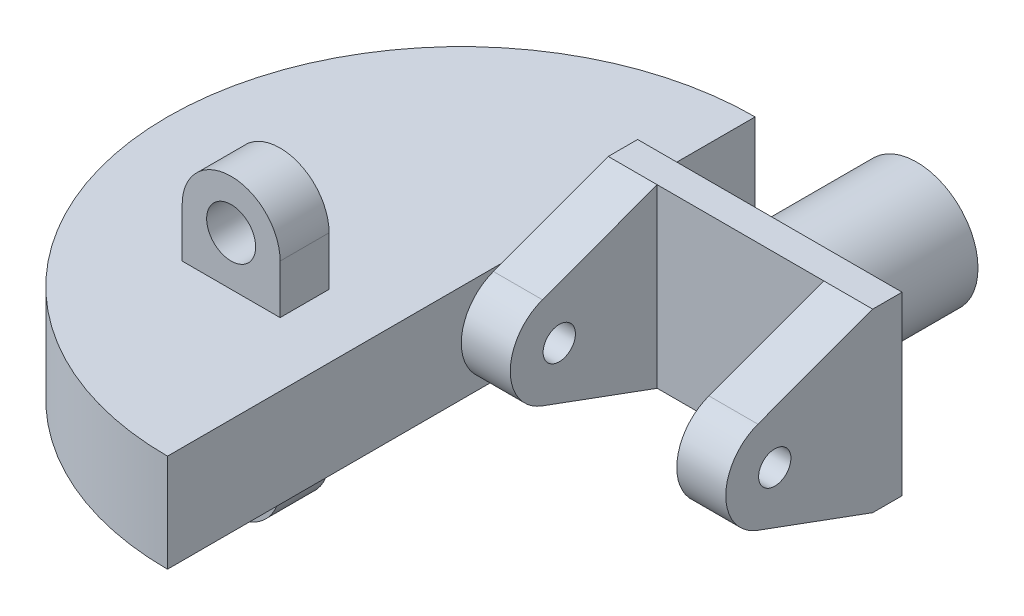
ISO-10303-21;
HEADER;
FILE_DESCRIPTION(('STEP AP214'),'2;1');
FILE_NAME('part.step','',(''),(''),'','','');
FILE_SCHEMA(('AUTOMOTIVE_DESIGN { 1 0 10303 214 1 1 1 1 }'));
ENDSEC;
DATA;
#1=APPLICATION_CONTEXT('core data for automotive mechanical design processes');
#2=APPLICATION_PROTOCOL_DEFINITION('international standard','automotive_design',2000,#1);
#3=PRODUCT_CONTEXT('',#1,'mechanical');
#4=PRODUCT('Part','Part','',(#3));
#5=PRODUCT_RELATED_PRODUCT_CATEGORY('part','',(#4));
#6=PRODUCT_DEFINITION_FORMATION('','',#4);
#7=PRODUCT_DEFINITION_CONTEXT('part definition',#1,'design');
#8=PRODUCT_DEFINITION('design','',#6,#7);
#9=PRODUCT_DEFINITION_SHAPE('','',#8);
#10=(LENGTH_UNIT() NAMED_UNIT(*) SI_UNIT(.MILLI.,.METRE.));
#11=(NAMED_UNIT(*) PLANE_ANGLE_UNIT() SI_UNIT($,.RADIAN.));
#12=(NAMED_UNIT(*) SI_UNIT($,.STERADIAN.) SOLID_ANGLE_UNIT());
#13=UNCERTAINTY_MEASURE_WITH_UNIT(LENGTH_MEASURE(1.E-05),#10,'distance_accuracy_value','');
#14=(GEOMETRIC_REPRESENTATION_CONTEXT(3) GLOBAL_UNCERTAINTY_ASSIGNED_CONTEXT((#13)) GLOBAL_UNIT_ASSIGNED_CONTEXT((#10,
#11,#12)) REPRESENTATION_CONTEXT('',''));
#15=CARTESIAN_POINT('',(0.,0.,0.));
#16=DIRECTION('',(0.,0.,1.));
#17=DIRECTION('',(1.,0.,0.));
#18=AXIS2_PLACEMENT_3D('',#15,#16,#17);
#19=CARTESIAN_POINT('',(-13.5,-5.,33.));
#20=DIRECTION('',(0.,1.,0.));
#21=DIRECTION('',(0.,0.,1.));
#22=AXIS2_PLACEMENT_3D('',#19,#20,#21);
#23=PLANE('',#22);
#24=CARTESIAN_POINT('',(-13.5,-5.,33.));
#25=DIRECTION('',(0.,1.,0.));
#26=DIRECTION('',(0.,0.,1.));
#27=AXIS2_PLACEMENT_3D('',#24,#25,#26);
#28=CIRCLE('',#27,30.);
#29=CARTESIAN_POINT('',(-13.5,-5.,3.));
#30=VERTEX_POINT('',#29);
#31=CARTESIAN_POINT('',(-13.5,-5.,63.));
#32=VERTEX_POINT('',#31);
#33=EDGE_CURVE('E245',#30,#32,#28,.T.);
#34=ORIENTED_EDGE('',*,*,#33,.F.);
#35=DIRECTION('',(0.,0.,-1.));
#36=VECTOR('',#35,1.);
#37=CARTESIAN_POINT('',(-13.5,-5.,63.));
#38=LINE('',#37,#36);
#39=CARTESIAN_POINT('',(-13.5,-5.,15.));
#40=VERTEX_POINT('',#39);
#41=EDGE_CURVE('E258',#40,#30,#38,.T.);
#42=ORIENTED_EDGE('',*,*,#41,.F.);
#43=CARTESIAN_POINT('',(-13.5,-5.,28.8892842845703));
#44=VERTEX_POINT('',#43);
#45=EDGE_CURVE('E261',#44,#40,#38,.T.);
#46=ORIENTED_EDGE('',*,*,#45,.F.);
#47=EDGE_CURVE('E250',#32,#44,#38,.T.);
#48=ORIENTED_EDGE('',*,*,#47,.F.);
#49=EDGE_LOOP('',(#34,#42,#46,#48));
#50=FACE_BOUND('',#49,.T.);
#51=DIRECTION('',(1.,0.,0.));
#52=VECTOR('',#51,1.);
#53=CARTESIAN_POINT('',(-30.,-5.,45.));
#54=LINE('',#53,#52);
#55=CARTESIAN_POINT('',(-30.,-5.,45.));
#56=VERTEX_POINT('',#55);
#57=CARTESIAN_POINT('',(-20.,-5.,45.));
#58=VERTEX_POINT('',#57);
#59=EDGE_CURVE('E185',#56,#58,#54,.T.);
#60=ORIENTED_EDGE('',*,*,#59,.T.);
#61=DIRECTION('',(0.,0.,-1.));
#62=VECTOR('',#61,1.);
#63=CARTESIAN_POINT('',(-20.,-5.,45.));
#64=LINE('',#63,#62);
#65=CARTESIAN_POINT('',(-20.,-5.,40.));
#66=VERTEX_POINT('',#65);
#67=EDGE_CURVE('E793',#58,#66,#64,.T.);
#68=ORIENTED_EDGE('',*,*,#67,.T.);
#69=DIRECTION('',(1.,0.,0.));
#70=VECTOR('',#69,1.);
#71=CARTESIAN_POINT('',(-30.,-5.,40.));
#72=LINE('',#71,#70);
#73=CARTESIAN_POINT('',(-30.,-5.,40.));
#74=VERTEX_POINT('',#73);
#75=EDGE_CURVE('E205',#74,#66,#72,.T.);
#76=ORIENTED_EDGE('',*,*,#75,.F.);
#77=DIRECTION('',(0.,0.,-1.));
#78=VECTOR('',#77,1.);
#79=CARTESIAN_POINT('',(-30.,-5.,45.));
#80=LINE('',#79,#78);
#81=EDGE_CURVE('E200',#56,#74,#80,.T.);
#82=ORIENTED_EDGE('',*,*,#81,.F.);
#83=EDGE_LOOP('',(#60,#68,#76,#82));
#84=FACE_BOUND('',#83,.T.);
#85=ADVANCED_FACE('F33',(#50,#84),#23,.F.);
#86=CARTESIAN_POINT('',(-13.5,5.,33.));
#87=DIRECTION('',(0.,1.,0.));
#88=DIRECTION('',(0.,0.,1.));
#89=AXIS2_PLACEMENT_3D('',#86,#87,#88);
#90=PLANE('',#89);
#91=CARTESIAN_POINT('',(-13.5,5.,33.));
#92=DIRECTION('',(0.,1.,0.));
#93=DIRECTION('',(0.,0.,1.));
#94=AXIS2_PLACEMENT_3D('',#91,#92,#93);
#95=CIRCLE('',#94,30.);
#96=CARTESIAN_POINT('',(-13.5,5.,3.));
#97=VERTEX_POINT('',#96);
#98=CARTESIAN_POINT('',(-13.5,5.,63.));
#99=VERTEX_POINT('',#98);
#100=EDGE_CURVE('E246',#97,#99,#95,.T.);
#101=ORIENTED_EDGE('',*,*,#100,.T.);
#102=DIRECTION('',(0.,0.,-1.));
#103=VECTOR('',#102,1.);
#104=CARTESIAN_POINT('',(-13.5,5.,63.));
#105=LINE('',#104,#103);
#106=CARTESIAN_POINT('',(-13.5,4.99999999999998,28.8892842845704));
#107=VERTEX_POINT('',#106);
#108=EDGE_CURVE('E251',#99,#107,#105,.T.);
#109=ORIENTED_EDGE('',*,*,#108,.T.);
#110=CARTESIAN_POINT('',(-13.5,5.,15.));
#111=VERTEX_POINT('',#110);
#112=EDGE_CURVE('E255',#107,#111,#105,.T.);
#113=ORIENTED_EDGE('',*,*,#112,.T.);
#114=EDGE_CURVE('E249',#111,#97,#105,.T.);
#115=ORIENTED_EDGE('',*,*,#114,.T.);
#116=EDGE_LOOP('',(#101,#109,#113,#115));
#117=FACE_BOUND('',#116,.T.);
#118=DIRECTION('',(1.,0.,0.));
#119=VECTOR('',#118,1.);
#120=CARTESIAN_POINT('',(-30.,5.,40.));
#121=LINE('',#120,#119);
#122=CARTESIAN_POINT('',(-30.,5.,40.));
#123=VERTEX_POINT('',#122);
#124=CARTESIAN_POINT('',(-20.,5.,40.));
#125=VERTEX_POINT('',#124);
#126=EDGE_CURVE('E56',#123,#125,#121,.T.);
#127=ORIENTED_EDGE('',*,*,#126,.T.);
#128=DIRECTION('',(0.,0.,-1.));
#129=VECTOR('',#128,1.);
#130=CARTESIAN_POINT('',(-20.,5.,45.));
#131=LINE('',#130,#129);
#132=CARTESIAN_POINT('',(-20.,5.,45.));
#133=VERTEX_POINT('',#132);
#134=EDGE_CURVE('E242',#133,#125,#131,.T.);
#135=ORIENTED_EDGE('',*,*,#134,.F.);
#136=DIRECTION('',(1.,0.,0.));
#137=VECTOR('',#136,1.);
#138=CARTESIAN_POINT('',(-30.,5.,45.));
#139=LINE('',#138,#137);
#140=CARTESIAN_POINT('',(-30.,5.,45.));
#141=VERTEX_POINT('',#140);
#142=EDGE_CURVE('E217',#141,#133,#139,.T.);
#143=ORIENTED_EDGE('',*,*,#142,.F.);
#144=DIRECTION('',(0.,0.,-1.));
#145=VECTOR('',#144,1.);
#146=CARTESIAN_POINT('',(-30.,5.,45.));
#147=LINE('',#146,#145);
#148=EDGE_CURVE('E227',#141,#123,#147,.T.);
#149=ORIENTED_EDGE('',*,*,#148,.T.);
#150=EDGE_LOOP('',(#127,#135,#143,#149));
#151=FACE_BOUND('',#150,.T.);
#152=ADVANCED_FACE('F388',(#117,#151),#90,.T.);
#153=CARTESIAN_POINT('',(-13.5,9.,18.));
#154=DIRECTION('',(1.,0.,0.));
#155=DIRECTION('',(0.,1.,0.));
#156=AXIS2_PLACEMENT_3D('',#153,#154,#155);
#157=PLANE('',#156);
#158=ORIENTED_EDGE('',*,*,#45,.T.);
#159=DIRECTION('',(0.,-1.,0.));
#160=VECTOR('',#159,1.);
#161=CARTESIAN_POINT('',(-13.5,9.,15.));
#162=LINE('',#161,#160);
#163=CARTESIAN_POINT('',(-13.5,-9.,15.));
#164=VERTEX_POINT('',#163);
#165=EDGE_CURVE('E352',#40,#164,#162,.T.);
#166=ORIENTED_EDGE('',*,*,#165,.T.);
#167=DIRECTION('',(0.,0.,-1.));
#168=VECTOR('',#167,1.);
#169=CARTESIAN_POINT('',(-13.5,-9.,18.));
#170=LINE('',#169,#168);
#171=CARTESIAN_POINT('',(-13.5,-9.,18.));
#172=VERTEX_POINT('',#171);
#173=EDGE_CURVE('E360',#172,#164,#170,.T.);
#174=ORIENTED_EDGE('',*,*,#173,.F.);
#175=DIRECTION('',(0.,-0.344806430779951,-0.938673811977724));
#176=VECTOR('',#175,1.);
#177=CARTESIAN_POINT('',(-13.5,-6.85995345527024,23.8258938019437));
#178=LINE('',#177,#176);
#179=EDGE_CURVE('E275',#44,#172,#178,.T.);
#180=ORIENTED_EDGE('',*,*,#179,.F.);
#181=EDGE_LOOP('',(#158,#166,#174,#180));
#182=FACE_BOUND('',#181,.T.);
#183=ADVANCED_FACE('F395',(#182),#157,.F.);
#184=CARTESIAN_POINT('',(0.,0.,18.));
#185=DIRECTION('',(0.,0.,1.));
#186=DIRECTION('',(1.,0.,0.));
#187=AXIS2_PLACEMENT_3D('',#184,#185,#186);
#188=PLANE('',#187);
#189=DIRECTION('',(0.,1.,0.));
#190=VECTOR('',#189,1.);
#191=CARTESIAN_POINT('',(-8.5,9.,18.));
#192=LINE('',#191,#190);
#193=CARTESIAN_POINT('',(-8.5,-9.,18.));
#194=VERTEX_POINT('',#193);
#195=CARTESIAN_POINT('',(-8.5,9.,18.));
#196=VERTEX_POINT('',#195);
#197=EDGE_CURVE('E281',#194,#196,#192,.T.);
#198=ORIENTED_EDGE('',*,*,#197,.F.);
#199=DIRECTION('',(1.,0.,0.));
#200=VECTOR('',#199,1.);
#201=CARTESIAN_POINT('',(-13.5,-9.,18.));
#202=LINE('',#201,#200);
#203=CARTESIAN_POINT('',(8.5,-9.,18.));
#204=VERTEX_POINT('',#203);
#205=EDGE_CURVE('E342',#194,#204,#202,.T.);
#206=ORIENTED_EDGE('',*,*,#205,.T.);
#207=DIRECTION('',(0.,1.,0.));
#208=VECTOR('',#207,1.);
#209=CARTESIAN_POINT('',(8.5,9.,18.));
#210=LINE('',#209,#208);
#211=CARTESIAN_POINT('',(8.5,9.,18.));
#212=VERTEX_POINT('',#211);
#213=EDGE_CURVE('E319',#204,#212,#210,.T.);
#214=ORIENTED_EDGE('',*,*,#213,.T.);
#215=DIRECTION('',(-1.,0.,0.));
#216=VECTOR('',#215,1.);
#217=CARTESIAN_POINT('',(-13.5,9.,18.));
#218=LINE('',#217,#216);
#219=EDGE_CURVE('E343',#212,#196,#218,.T.);
#220=ORIENTED_EDGE('',*,*,#219,.T.);
#221=EDGE_LOOP('',(#198,#206,#214,#220));
#222=FACE_BOUND('',#221,.T.);
#223=ADVANCED_FACE('F385',(#222),#188,.T.);
#224=CARTESIAN_POINT('',(0.,0.,15.));
#225=DIRECTION('',(0.,0.,-1.));
#226=DIRECTION('',(-1.,0.,0.));
#227=AXIS2_PLACEMENT_3D('',#224,#225,#226);
#228=CYLINDRICAL_SURFACE('',#227,6.25);
#229=CARTESIAN_POINT('',(0.,0.,15.));
#230=DIRECTION('',(0.,0.,1.));
#231=DIRECTION('',(1.,0.,0.));
#232=AXIS2_PLACEMENT_3D('',#229,#230,#231);
#233=CIRCLE('',#232,6.25);
#234=CARTESIAN_POINT('',(6.25,0.,15.));
#235=VERTEX_POINT('',#234);
#236=EDGE_CURVE('E11',#235,#235,#233,.T.);
#237=ORIENTED_EDGE('',*,*,#236,.F.);
#238=EDGE_LOOP('',(#237));
#239=FACE_BOUND('',#238,.T.);
#240=CARTESIAN_POINT('',(0.,0.,0.));
#241=DIRECTION('',(0.,0.,1.));
#242=DIRECTION('',(1.,0.,0.));
#243=AXIS2_PLACEMENT_3D('',#240,#241,#242);
#244=CIRCLE('',#243,6.25);
#245=CARTESIAN_POINT('',(6.25,0.,0.));
#246=VERTEX_POINT('',#245);
#247=EDGE_CURVE('E37',#246,#246,#244,.T.);
#248=ORIENTED_EDGE('',*,*,#247,.T.);
#249=EDGE_LOOP('',(#248));
#250=FACE_BOUND('',#249,.T.);
#251=ADVANCED_FACE('F35',(#239,#250),#228,.T.);
#252=CARTESIAN_POINT('',(0.,0.,0.));
#253=DIRECTION('',(0.,0.,1.));
#254=DIRECTION('',(1.,0.,0.));
#255=AXIS2_PLACEMENT_3D('',#252,#253,#254);
#256=PLANE('',#255);
#257=ORIENTED_EDGE('',*,*,#247,.F.);
#258=EDGE_LOOP('',(#257));
#259=FACE_BOUND('',#258,.T.);
#260=ADVANCED_FACE('F375',(#259),#256,.F.);
#261=CARTESIAN_POINT('',(13.5,9.,18.));
#262=DIRECTION('',(-1.,0.,0.));
#263=DIRECTION('',(0.,-1.,0.));
#264=AXIS2_PLACEMENT_3D('',#261,#262,#263);
#265=PLANE('',#264);
#266=DIRECTION('',(0.,1.,0.));
#267=VECTOR('',#266,1.);
#268=CARTESIAN_POINT('',(13.5,9.,15.));
#269=LINE('',#268,#267);
#270=CARTESIAN_POINT('',(13.5,-9.,15.));
#271=VERTEX_POINT('',#270);
#272=CARTESIAN_POINT('',(13.5,9.,15.));
#273=VERTEX_POINT('',#272);
#274=EDGE_CURVE('E338',#271,#273,#269,.T.);
#275=ORIENTED_EDGE('',*,*,#274,.T.);
#276=DIRECTION('',(0.,0.,-1.));
#277=VECTOR('',#276,1.);
#278=CARTESIAN_POINT('',(13.5,9.,18.));
#279=LINE('',#278,#277);
#280=CARTESIAN_POINT('',(13.5,9.,18.));
#281=VERTEX_POINT('',#280);
#282=EDGE_CURVE('E366',#281,#273,#279,.T.);
#283=ORIENTED_EDGE('',*,*,#282,.F.);
#284=DIRECTION('',(0.,-0.344806430779952,0.938673811977723));
#285=VECTOR('',#284,1.);
#286=CARTESIAN_POINT('',(13.5,9.,18.));
#287=LINE('',#286,#285);
#288=CARTESIAN_POINT('',(13.5,4.69336905988861,29.7240321538998));
#289=VERTEX_POINT('',#288);
#290=EDGE_CURVE('E328',#281,#289,#287,.T.);
#291=ORIENTED_EDGE('',*,*,#290,.T.);
#292=CARTESIAN_POINT('',(13.5,0.,28.));
#293=DIRECTION('',(-1.,0.,0.));
#294=DIRECTION('',(0.,-1.,0.));
#295=AXIS2_PLACEMENT_3D('',#292,#293,#294);
#296=CIRCLE('',#295,5.);
#297=CARTESIAN_POINT('',(13.5,-4.69336905988862,29.7240321538998));
#298=VERTEX_POINT('',#297);
#299=EDGE_CURVE('E310',#298,#289,#296,.T.);
#300=ORIENTED_EDGE('',*,*,#299,.F.);
#301=DIRECTION('',(0.,-0.344806430779951,-0.938673811977724));
#302=VECTOR('',#301,1.);
#303=CARTESIAN_POINT('',(13.5,-6.85995345527023,23.8258938019437));
#304=LINE('',#303,#302);
#305=CARTESIAN_POINT('',(13.5,-9.,18.));
#306=VERTEX_POINT('',#305);
#307=EDGE_CURVE('E316',#298,#306,#304,.T.);
#308=ORIENTED_EDGE('',*,*,#307,.T.);
#309=DIRECTION('',(0.,0.,-1.));
#310=VECTOR('',#309,1.);
#311=CARTESIAN_POINT('',(13.5,-9.,18.));
#312=LINE('',#311,#310);
#313=EDGE_CURVE('E347',#306,#271,#312,.T.);
#314=ORIENTED_EDGE('',*,*,#313,.T.);
#315=EDGE_LOOP('',(#275,#283,#291,#300,#308,#314));
#316=FACE_BOUND('',#315,.T.);
#317=CARTESIAN_POINT('',(13.5,0.,28.));
#318=DIRECTION('',(-1.,0.,0.));
#319=DIRECTION('',(0.,-1.,0.));
#320=AXIS2_PLACEMENT_3D('',#317,#318,#319);
#321=CIRCLE('',#320,1.65);
#322=CARTESIAN_POINT('',(13.5,-1.65,28.));
#323=VERTEX_POINT('',#322);
#324=EDGE_CURVE('E306',#323,#323,#321,.T.);
#325=ORIENTED_EDGE('',*,*,#324,.T.);
#326=EDGE_LOOP('',(#325));
#327=FACE_BOUND('',#326,.T.);
#328=ADVANCED_FACE('F377',(#316,#327),#265,.F.);
#329=CARTESIAN_POINT('',(-13.5,9.,18.));
#330=DIRECTION('',(0.,-1.,0.));
#331=DIRECTION('',(0.,0.,-1.));
#332=AXIS2_PLACEMENT_3D('',#329,#330,#331);
#333=PLANE('',#332);
#334=DIRECTION('',(-1.,0.,0.));
#335=VECTOR('',#334,1.);
#336=CARTESIAN_POINT('',(-13.5,9.,15.));
#337=LINE('',#336,#335);
#338=CARTESIAN_POINT('',(-13.5,9.,15.));
#339=VERTEX_POINT('',#338);
#340=EDGE_CURVE('E350',#273,#339,#337,.T.);
#341=ORIENTED_EDGE('',*,*,#340,.T.);
#342=DIRECTION('',(0.,0.,-1.));
#343=VECTOR('',#342,1.);
#344=CARTESIAN_POINT('',(-13.5,9.,18.));
#345=LINE('',#344,#343);
#346=CARTESIAN_POINT('',(-13.5,9.,18.));
#347=VERTEX_POINT('',#346);
#348=EDGE_CURVE('E363',#347,#339,#345,.T.);
#349=ORIENTED_EDGE('',*,*,#348,.F.);
#350=DIRECTION('',(-1.,0.,0.));
#351=VECTOR('',#350,1.);
#352=CARTESIAN_POINT('',(-8.5,9.,18.));
#353=LINE('',#352,#351);
#354=EDGE_CURVE('E303',#196,#347,#353,.T.);
#355=ORIENTED_EDGE('',*,*,#354,.F.);
#356=ORIENTED_EDGE('',*,*,#219,.F.);
#357=EDGE_CURVE('E339',#281,#212,#218,.T.);
#358=ORIENTED_EDGE('',*,*,#357,.F.);
#359=ORIENTED_EDGE('',*,*,#282,.T.);
#360=EDGE_LOOP('',(#341,#349,#355,#356,#358,#359));
#361=FACE_BOUND('',#360,.T.);
#362=ADVANCED_FACE('F382',(#361),#333,.F.);
#363=EDGE_CURVE('E353',#339,#111,#162,.T.);
#364=ORIENTED_EDGE('',*,*,#363,.T.);
#365=ORIENTED_EDGE('',*,*,#112,.F.);
#366=DIRECTION('',(0.,-0.344806430779952,0.938673811977724));
#367=VECTOR('',#366,1.);
#368=CARTESIAN_POINT('',(-13.5,9.,18.));
#369=LINE('',#368,#367);
#370=EDGE_CURVE('E293',#347,#107,#369,.T.);
#371=ORIENTED_EDGE('',*,*,#370,.F.);
#372=ORIENTED_EDGE('',*,*,#348,.T.);
#373=EDGE_LOOP('',(#364,#365,#371,#372));
#374=FACE_BOUND('',#373,.T.);
#375=ADVANCED_FACE('F462',(#374),#157,.F.);
#376=CARTESIAN_POINT('',(-13.5,-9.,18.));
#377=DIRECTION('',(0.,1.,0.));
#378=DIRECTION('',(0.,0.,1.));
#379=AXIS2_PLACEMENT_3D('',#376,#377,#378);
#380=PLANE('',#379);
#381=DIRECTION('',(1.,0.,0.));
#382=VECTOR('',#381,1.);
#383=CARTESIAN_POINT('',(-13.5,-9.,15.));
#384=LINE('',#383,#382);
#385=EDGE_CURVE('E356',#164,#271,#384,.T.);
#386=ORIENTED_EDGE('',*,*,#385,.T.);
#387=ORIENTED_EDGE('',*,*,#313,.F.);
#388=DIRECTION('',(1.,0.,0.));
#389=VECTOR('',#388,1.);
#390=CARTESIAN_POINT('',(8.5,-9.,18.));
#391=LINE('',#390,#389);
#392=EDGE_CURVE('E334',#204,#306,#391,.T.);
#393=ORIENTED_EDGE('',*,*,#392,.F.);
#394=ORIENTED_EDGE('',*,*,#205,.F.);
#395=EDGE_CURVE('E344',#172,#194,#202,.T.);
#396=ORIENTED_EDGE('',*,*,#395,.F.);
#397=ORIENTED_EDGE('',*,*,#173,.T.);
#398=EDGE_LOOP('',(#386,#387,#393,#394,#396,#397));
#399=FACE_BOUND('',#398,.T.);
#400=ADVANCED_FACE('F458',(#399),#380,.F.);
#401=CARTESIAN_POINT('',(0.,0.,15.));
#402=DIRECTION('',(0.,0.,1.));
#403=DIRECTION('',(1.,0.,0.));
#404=AXIS2_PLACEMENT_3D('',#401,#402,#403);
#405=PLANE('',#404);
#406=ORIENTED_EDGE('',*,*,#236,.T.);
#407=EDGE_LOOP('',(#406));
#408=FACE_BOUND('',#407,.T.);
#409=ORIENTED_EDGE('',*,*,#274,.F.);
#410=ORIENTED_EDGE('',*,*,#385,.F.);
#411=ORIENTED_EDGE('',*,*,#165,.F.);
#412=DIRECTION('',(0.,-1.,0.));
#413=VECTOR('',#412,1.);
#414=CARTESIAN_POINT('',(-13.5,0.,15.));
#415=LINE('',#414,#413);
#416=EDGE_CURVE('E269',#111,#40,#415,.T.);
#417=ORIENTED_EDGE('',*,*,#416,.F.);
#418=ORIENTED_EDGE('',*,*,#363,.F.);
#419=ORIENTED_EDGE('',*,*,#340,.F.);
#420=EDGE_LOOP('',(#409,#410,#411,#417,#418,#419));
#421=FACE_BOUND('',#420,.T.);
#422=ADVANCED_FACE('F441',(#408,#421),#405,.F.);
#423=CARTESIAN_POINT('',(8.5,0.,28.));
#424=DIRECTION('',(-1.,0.,0.));
#425=DIRECTION('',(0.,-1.,0.));
#426=AXIS2_PLACEMENT_3D('',#423,#424,#425);
#427=PLANE('',#426);
#428=CARTESIAN_POINT('',(8.5,0.,28.));
#429=DIRECTION('',(-1.,0.,0.));
#430=DIRECTION('',(0.,-1.,0.));
#431=AXIS2_PLACEMENT_3D('',#428,#429,#430);
#432=CIRCLE('',#431,5.);
#433=CARTESIAN_POINT('',(8.5,-4.69336905988862,29.7240321538998));
#434=VERTEX_POINT('',#433);
#435=CARTESIAN_POINT('',(8.5,4.69336905988861,29.7240321538998));
#436=VERTEX_POINT('',#435);
#437=EDGE_CURVE('E313',#434,#436,#432,.T.);
#438=ORIENTED_EDGE('',*,*,#437,.T.);
#439=DIRECTION('',(0.,-0.344806430779952,0.938673811977723));
#440=VECTOR('',#439,1.);
#441=CARTESIAN_POINT('',(8.5,9.,18.));
#442=LINE('',#441,#440);
#443=EDGE_CURVE('E315',#212,#436,#442,.T.);
#444=ORIENTED_EDGE('',*,*,#443,.F.);
#445=ORIENTED_EDGE('',*,*,#213,.F.);
#446=DIRECTION('',(0.,-0.344806430779951,-0.938673811977724));
#447=VECTOR('',#446,1.);
#448=CARTESIAN_POINT('',(8.5,-6.85995345527023,23.8258938019437));
#449=LINE('',#448,#447);
#450=EDGE_CURVE('E322',#434,#204,#449,.T.);
#451=ORIENTED_EDGE('',*,*,#450,.F.);
#452=EDGE_LOOP('',(#438,#444,#445,#451));
#453=FACE_BOUND('',#452,.T.);
#454=CARTESIAN_POINT('',(8.5,0.,28.));
#455=DIRECTION('',(-1.,0.,0.));
#456=DIRECTION('',(0.,-1.,0.));
#457=AXIS2_PLACEMENT_3D('',#454,#455,#456);
#458=CIRCLE('',#457,1.65);
#459=CARTESIAN_POINT('',(8.5,-1.65,28.));
#460=VERTEX_POINT('',#459);
#461=EDGE_CURVE('E307',#460,#460,#458,.T.);
#462=ORIENTED_EDGE('',*,*,#461,.F.);
#463=EDGE_LOOP('',(#462));
#464=FACE_BOUND('',#463,.T.);
#465=ADVANCED_FACE('F437',(#453,#464),#427,.T.);
#466=CARTESIAN_POINT('',(8.5,0.,28.));
#467=DIRECTION('',(1.,0.,0.));
#468=DIRECTION('',(0.,0.,-1.));
#469=AXIS2_PLACEMENT_3D('',#466,#467,#468);
#470=CYLINDRICAL_SURFACE('',#469,5.);
#471=ORIENTED_EDGE('',*,*,#299,.T.);
#472=DIRECTION('',(1.,0.,0.));
#473=VECTOR('',#472,1.);
#474=CARTESIAN_POINT('',(8.5,4.69336905988861,29.7240321538998));
#475=LINE('',#474,#473);
#476=EDGE_CURVE('E336',#436,#289,#475,.T.);
#477=ORIENTED_EDGE('',*,*,#476,.F.);
#478=ORIENTED_EDGE('',*,*,#437,.F.);
#479=DIRECTION('',(1.,0.,0.));
#480=VECTOR('',#479,1.);
#481=CARTESIAN_POINT('',(8.5,-4.69336905988862,29.7240321538998));
#482=LINE('',#481,#480);
#483=EDGE_CURVE('E325',#434,#298,#482,.T.);
#484=ORIENTED_EDGE('',*,*,#483,.T.);
#485=EDGE_LOOP('',(#471,#477,#478,#484));
#486=FACE_BOUND('',#485,.T.);
#487=ADVANCED_FACE('F440',(#486),#470,.T.);
#488=CARTESIAN_POINT('',(8.5,9.,18.));
#489=DIRECTION('',(0.,0.938673811977723,0.344806430779952));
#490=DIRECTION('',(0.,-0.344806430779952,0.938673811977724));
#491=AXIS2_PLACEMENT_3D('',#488,#489,#490);
#492=PLANE('',#491);
#493=ORIENTED_EDGE('',*,*,#290,.F.);
#494=ORIENTED_EDGE('',*,*,#357,.T.);
#495=ORIENTED_EDGE('',*,*,#443,.T.);
#496=ORIENTED_EDGE('',*,*,#476,.T.);
#497=EDGE_LOOP('',(#493,#494,#495,#496));
#498=FACE_BOUND('',#497,.T.);
#499=ADVANCED_FACE('F445',(#498),#492,.T.);
#500=CARTESIAN_POINT('',(8.5,-6.85995345527023,23.8258938019437));
#501=DIRECTION('',(0.,-0.938673811977724,0.344806430779951));
#502=DIRECTION('',(0.,-0.344806430779951,-0.938673811977724));
#503=AXIS2_PLACEMENT_3D('',#500,#501,#502);
#504=PLANE('',#503);
#505=ORIENTED_EDGE('',*,*,#307,.F.);
#506=ORIENTED_EDGE('',*,*,#483,.F.);
#507=ORIENTED_EDGE('',*,*,#450,.T.);
#508=ORIENTED_EDGE('',*,*,#392,.T.);
#509=EDGE_LOOP('',(#505,#506,#507,#508));
#510=FACE_BOUND('',#509,.T.);
#511=ADVANCED_FACE('F435',(#510),#504,.T.);
#512=CARTESIAN_POINT('',(8.5,0.,28.));
#513=DIRECTION('',(1.,0.,0.));
#514=DIRECTION('',(0.,0.,-1.));
#515=AXIS2_PLACEMENT_3D('',#512,#513,#514);
#516=CYLINDRICAL_SURFACE('',#515,1.65);
#517=ORIENTED_EDGE('',*,*,#461,.T.);
#518=EDGE_LOOP('',(#517));
#519=FACE_BOUND('',#518,.T.);
#520=ORIENTED_EDGE('',*,*,#324,.F.);
#521=EDGE_LOOP('',(#520));
#522=FACE_BOUND('',#521,.T.);
#523=ADVANCED_FACE('F421',(#519,#522),#516,.F.);
#524=CARTESIAN_POINT('',(-8.5,0.,28.));
#525=DIRECTION('',(1.,0.,0.));
#526=DIRECTION('',(0.,1.,0.));
#527=AXIS2_PLACEMENT_3D('',#524,#525,#526);
#528=PLANE('',#527);
#529=DIRECTION('',(0.,-0.344806430779951,-0.938673811977724));
#530=VECTOR('',#529,1.);
#531=CARTESIAN_POINT('',(-8.5,-6.85995345527024,23.8258938019437));
#532=LINE('',#531,#530);
#533=CARTESIAN_POINT('',(-8.5,-4.69336905988862,29.7240321538998));
#534=VERTEX_POINT('',#533);
#535=EDGE_CURVE('E278',#534,#194,#532,.T.);
#536=ORIENTED_EDGE('',*,*,#535,.T.);
#537=ORIENTED_EDGE('',*,*,#197,.T.);
#538=DIRECTION('',(0.,-0.344806430779952,0.938673811977724));
#539=VECTOR('',#538,1.);
#540=CARTESIAN_POINT('',(-8.5,9.,18.));
#541=LINE('',#540,#539);
#542=CARTESIAN_POINT('',(-8.5,4.69336905988861,29.7240321538998));
#543=VERTEX_POINT('',#542);
#544=EDGE_CURVE('E285',#196,#543,#541,.T.);
#545=ORIENTED_EDGE('',*,*,#544,.T.);
#546=CARTESIAN_POINT('',(-8.5,0.,28.));
#547=DIRECTION('',(1.,0.,0.));
#548=DIRECTION('',(0.,1.,0.));
#549=AXIS2_PLACEMENT_3D('',#546,#547,#548);
#550=CIRCLE('',#549,5.);
#551=EDGE_CURVE('E287',#543,#534,#550,.T.);
#552=ORIENTED_EDGE('',*,*,#551,.T.);
#553=EDGE_LOOP('',(#536,#537,#545,#552));
#554=FACE_BOUND('',#553,.T.);
#555=CARTESIAN_POINT('',(-8.5,0.,28.));
#556=DIRECTION('',(1.,0.,0.));
#557=DIRECTION('',(0.,1.,0.));
#558=AXIS2_PLACEMENT_3D('',#555,#556,#557);
#559=CIRCLE('',#558,1.65);
#560=CARTESIAN_POINT('',(-8.5,1.65,28.));
#561=VERTEX_POINT('',#560);
#562=EDGE_CURVE('E272',#561,#561,#559,.T.);
#563=ORIENTED_EDGE('',*,*,#562,.F.);
#564=EDGE_LOOP('',(#563));
#565=FACE_BOUND('',#564,.T.);
#566=ADVANCED_FACE('F417',(#554,#565),#528,.T.);
#567=CARTESIAN_POINT('',(-8.5,-6.85995345527024,23.8258938019437));
#568=DIRECTION('',(0.,0.938673811977724,-0.344806430779951));
#569=DIRECTION('',(0.,0.344806430779951,0.938673811977724));
#570=AXIS2_PLACEMENT_3D('',#567,#568,#569);
#571=PLANE('',#570);
#572=CARTESIAN_POINT('',(-13.5,-4.69336905988862,29.7240321538998));
#573=VERTEX_POINT('',#572);
#574=EDGE_CURVE('E290',#573,#44,#178,.T.);
#575=ORIENTED_EDGE('',*,*,#574,.T.);
#576=ORIENTED_EDGE('',*,*,#179,.T.);
#577=ORIENTED_EDGE('',*,*,#395,.T.);
#578=ORIENTED_EDGE('',*,*,#535,.F.);
#579=DIRECTION('',(-1.,0.,0.));
#580=VECTOR('',#579,1.);
#581=CARTESIAN_POINT('',(-8.5,-4.69336905988862,29.7240321538998));
#582=LINE('',#581,#580);
#583=EDGE_CURVE('E289',#534,#573,#582,.T.);
#584=ORIENTED_EDGE('',*,*,#583,.T.);
#585=EDGE_LOOP('',(#575,#576,#577,#578,#584));
#586=FACE_BOUND('',#585,.T.);
#587=ADVANCED_FACE('F420',(#586),#571,.F.);
#588=CARTESIAN_POINT('',(-8.5,9.,18.));
#589=DIRECTION('',(0.,-0.938673811977723,-0.344806430779952));
#590=DIRECTION('',(0.,0.344806430779952,-0.938673811977724));
#591=AXIS2_PLACEMENT_3D('',#588,#589,#590);
#592=PLANE('',#591);
#593=ORIENTED_EDGE('',*,*,#370,.T.);
#594=DIRECTION('',(0.,0.344806430779952,-0.938673811977724));
#595=VECTOR('',#594,1.);
#596=CARTESIAN_POINT('',(-13.5,9.,18.));
#597=LINE('',#596,#595);
#598=CARTESIAN_POINT('',(-13.5,4.69336905988861,29.7240321538998));
#599=VERTEX_POINT('',#598);
#600=EDGE_CURVE('E267',#599,#107,#597,.T.);
#601=ORIENTED_EDGE('',*,*,#600,.F.);
#602=DIRECTION('',(-1.,0.,0.));
#603=VECTOR('',#602,1.);
#604=CARTESIAN_POINT('',(-8.5,4.69336905988861,29.7240321538998));
#605=LINE('',#604,#603);
#606=EDGE_CURVE('E300',#543,#599,#605,.T.);
#607=ORIENTED_EDGE('',*,*,#606,.F.);
#608=ORIENTED_EDGE('',*,*,#544,.F.);
#609=ORIENTED_EDGE('',*,*,#354,.T.);
#610=EDGE_LOOP('',(#593,#601,#607,#608,#609));
#611=FACE_BOUND('',#610,.T.);
#612=ADVANCED_FACE('F425',(#611),#592,.F.);
#613=CARTESIAN_POINT('',(-8.5,0.,28.));
#614=DIRECTION('',(-1.,0.,0.));
#615=DIRECTION('',(0.,0.,1.));
#616=AXIS2_PLACEMENT_3D('',#613,#614,#615);
#617=CYLINDRICAL_SURFACE('',#616,5.);
#618=CARTESIAN_POINT('',(-13.5,0.,28.));
#619=DIRECTION('',(1.,0.,0.));
#620=DIRECTION('',(0.,1.,0.));
#621=AXIS2_PLACEMENT_3D('',#618,#619,#620);
#622=CIRCLE('',#621,5.);
#623=EDGE_CURVE('E282',#599,#573,#622,.T.);
#624=ORIENTED_EDGE('',*,*,#623,.T.);
#625=ORIENTED_EDGE('',*,*,#583,.F.);
#626=ORIENTED_EDGE('',*,*,#551,.F.);
#627=ORIENTED_EDGE('',*,*,#606,.T.);
#628=EDGE_LOOP('',(#624,#625,#626,#627));
#629=FACE_BOUND('',#628,.T.);
#630=ADVANCED_FACE('F415',(#629),#617,.T.);
#631=CARTESIAN_POINT('',(-8.5,0.,28.));
#632=DIRECTION('',(-1.,0.,0.));
#633=DIRECTION('',(0.,0.,1.));
#634=AXIS2_PLACEMENT_3D('',#631,#632,#633);
#635=CYLINDRICAL_SURFACE('',#634,1.65);
#636=ORIENTED_EDGE('',*,*,#562,.T.);
#637=EDGE_LOOP('',(#636));
#638=FACE_BOUND('',#637,.T.);
#639=CARTESIAN_POINT('',(-13.5,0.,28.));
#640=DIRECTION('',(1.,0.,0.));
#641=DIRECTION('',(0.,1.,0.));
#642=AXIS2_PLACEMENT_3D('',#639,#640,#641);
#643=CIRCLE('',#642,1.65);
#644=CARTESIAN_POINT('',(-13.5,1.65,28.));
#645=VERTEX_POINT('',#644);
#646=EDGE_CURVE('E271',#645,#645,#643,.T.);
#647=ORIENTED_EDGE('',*,*,#646,.F.);
#648=EDGE_LOOP('',(#647));
#649=FACE_BOUND('',#648,.T.);
#650=ADVANCED_FACE('F412',(#638,#649),#635,.F.);
#651=CARTESIAN_POINT('',(-13.5,5.,63.));
#652=DIRECTION('',(-1.,0.,0.));
#653=DIRECTION('',(0.,0.,1.));
#654=AXIS2_PLACEMENT_3D('',#651,#652,#653);
#655=PLANE('',#654);
#656=ORIENTED_EDGE('',*,*,#646,.T.);
#657=EDGE_LOOP('',(#656));
#658=FACE_BOUND('',#657,.T.);
#659=ADVANCED_FACE('F408',(#658),#655,.F.);
#660=ORIENTED_EDGE('',*,*,#114,.F.);
#661=ORIENTED_EDGE('',*,*,#416,.T.);
#662=ORIENTED_EDGE('',*,*,#41,.T.);
#663=DIRECTION('',(0.,-1.,0.));
#664=VECTOR('',#663,1.);
#665=CARTESIAN_POINT('',(-13.5,5.,3.));
#666=LINE('',#665,#664);
#667=EDGE_CURVE('E254',#97,#30,#666,.T.);
#668=ORIENTED_EDGE('',*,*,#667,.F.);
#669=EDGE_LOOP('',(#660,#661,#662,#668));
#670=FACE_BOUND('',#669,.T.);
#671=ADVANCED_FACE('F407',(#670),#655,.F.);
#672=CARTESIAN_POINT('',(-13.5,5.,33.));
#673=DIRECTION('',(0.,-1.,0.));
#674=DIRECTION('',(0.,0.,-1.));
#675=AXIS2_PLACEMENT_3D('',#672,#673,#674);
#676=CYLINDRICAL_SURFACE('',#675,30.);
#677=ORIENTED_EDGE('',*,*,#33,.T.);
#678=DIRECTION('',(0.,-1.,0.));
#679=VECTOR('',#678,1.);
#680=CARTESIAN_POINT('',(-13.5,5.,63.));
#681=LINE('',#680,#679);
#682=EDGE_CURVE('E264',#99,#32,#681,.T.);
#683=ORIENTED_EDGE('',*,*,#682,.F.);
#684=ORIENTED_EDGE('',*,*,#100,.F.);
#685=ORIENTED_EDGE('',*,*,#667,.T.);
#686=EDGE_LOOP('',(#677,#683,#684,#685));
#687=FACE_BOUND('',#686,.T.);
#688=ADVANCED_FACE('F405',(#687),#676,.T.);
#689=ORIENTED_EDGE('',*,*,#47,.T.);
#690=ORIENTED_EDGE('',*,*,#574,.F.);
#691=ORIENTED_EDGE('',*,*,#623,.F.);
#692=ORIENTED_EDGE('',*,*,#600,.T.);
#693=ORIENTED_EDGE('',*,*,#108,.F.);
#694=ORIENTED_EDGE('',*,*,#682,.T.);
#695=EDGE_LOOP('',(#689,#690,#691,#692,#693,#694));
#696=FACE_BOUND('',#695,.T.);
#697=ADVANCED_FACE('F401',(#696),#655,.F.);
#698=CARTESIAN_POINT('',(-25.,10.,45.));
#699=DIRECTION('',(0.,0.,-1.));
#700=DIRECTION('',(-1.,0.,0.));
#701=AXIS2_PLACEMENT_3D('',#698,#699,#700);
#702=PLANE('',#701);
#703=ORIENTED_EDGE('',*,*,#142,.T.);
#704=DIRECTION('',(0.,1.,0.));
#705=VECTOR('',#704,1.);
#706=CARTESIAN_POINT('',(-20.,10.,45.));
#707=LINE('',#706,#705);
#708=CARTESIAN_POINT('',(-20.,10.,45.));
#709=VERTEX_POINT('',#708);
#710=EDGE_CURVE('E220',#133,#709,#707,.T.);
#711=ORIENTED_EDGE('',*,*,#710,.T.);
#712=CARTESIAN_POINT('',(-25.,10.,45.));
#713=DIRECTION('',(0.,0.,1.));
#714=DIRECTION('',(-1.,0.,0.));
#715=AXIS2_PLACEMENT_3D('',#712,#713,#714);
#716=CIRCLE('',#715,5.);
#717=CARTESIAN_POINT('',(-30.,10.,45.));
#718=VERTEX_POINT('',#717);
#719=EDGE_CURVE('E223',#709,#718,#716,.T.);
#720=ORIENTED_EDGE('',*,*,#719,.T.);
#721=DIRECTION('',(0.,-1.,0.));
#722=VECTOR('',#721,1.);
#723=CARTESIAN_POINT('',(-30.,5.,45.));
#724=LINE('',#723,#722);
#725=EDGE_CURVE('E225',#718,#141,#724,.T.);
#726=ORIENTED_EDGE('',*,*,#725,.T.);
#727=EDGE_LOOP('',(#703,#711,#720,#726));
#728=FACE_BOUND('',#727,.T.);
#729=CARTESIAN_POINT('',(-25.,10.,45.));
#730=DIRECTION('',(0.,0.,1.));
#731=DIRECTION('',(1.,0.,0.));
#732=AXIS2_PLACEMENT_3D('',#729,#730,#731);
#733=CIRCLE('',#732,2.5);
#734=CARTESIAN_POINT('',(-22.5,10.,45.));
#735=VERTEX_POINT('',#734);
#736=EDGE_CURVE('E209',#735,#735,#733,.T.);
#737=ORIENTED_EDGE('',*,*,#736,.F.);
#738=EDGE_LOOP('',(#737));
#739=FACE_BOUND('',#738,.T.);
#740=ADVANCED_FACE('F404',(#728,#739),#702,.F.);
#741=CARTESIAN_POINT('',(-25.,10.,40.));
#742=DIRECTION('',(0.,0.,-1.));
#743=DIRECTION('',(-1.,0.,0.));
#744=AXIS2_PLACEMENT_3D('',#741,#742,#743);
#745=PLANE('',#744);
#746=ORIENTED_EDGE('',*,*,#126,.F.);
#747=DIRECTION('',(0.,-1.,0.));
#748=VECTOR('',#747,1.);
#749=CARTESIAN_POINT('',(-30.,5.,40.));
#750=LINE('',#749,#748);
#751=CARTESIAN_POINT('',(-30.,10.,40.));
#752=VERTEX_POINT('',#751);
#753=EDGE_CURVE('E221',#752,#123,#750,.T.);
#754=ORIENTED_EDGE('',*,*,#753,.F.);
#755=CARTESIAN_POINT('',(-25.,10.,40.));
#756=DIRECTION('',(0.,0.,1.));
#757=DIRECTION('',(-1.,0.,0.));
#758=AXIS2_PLACEMENT_3D('',#755,#756,#757);
#759=CIRCLE('',#758,5.);
#760=CARTESIAN_POINT('',(-20.,10.,40.));
#761=VERTEX_POINT('',#760);
#762=EDGE_CURVE('E231',#761,#752,#759,.T.);
#763=ORIENTED_EDGE('',*,*,#762,.F.);
#764=DIRECTION('',(0.,1.,0.));
#765=VECTOR('',#764,1.);
#766=CARTESIAN_POINT('',(-20.,10.,40.));
#767=LINE('',#766,#765);
#768=EDGE_CURVE('E229',#125,#761,#767,.T.);
#769=ORIENTED_EDGE('',*,*,#768,.F.);
#770=EDGE_LOOP('',(#746,#754,#763,#769));
#771=FACE_BOUND('',#770,.T.);
#772=CARTESIAN_POINT('',(-25.,10.,40.));
#773=DIRECTION('',(0.,0.,1.));
#774=DIRECTION('',(1.,0.,0.));
#775=AXIS2_PLACEMENT_3D('',#772,#773,#774);
#776=CIRCLE('',#775,2.5);
#777=CARTESIAN_POINT('',(-22.5,10.,40.));
#778=VERTEX_POINT('',#777);
#779=EDGE_CURVE('E206',#778,#778,#776,.T.);
#780=ORIENTED_EDGE('',*,*,#779,.T.);
#781=EDGE_LOOP('',(#780));
#782=FACE_BOUND('',#781,.T.);
#783=ADVANCED_FACE('F505',(#771,#782),#745,.T.);
#784=CARTESIAN_POINT('',(-20.,10.,45.));
#785=DIRECTION('',(-1.,0.,0.));
#786=DIRECTION('',(0.,-1.,0.));
#787=AXIS2_PLACEMENT_3D('',#784,#785,#786);
#788=PLANE('',#787);
#789=ORIENTED_EDGE('',*,*,#768,.T.);
#790=DIRECTION('',(0.,0.,-1.));
#791=VECTOR('',#790,1.);
#792=CARTESIAN_POINT('',(-20.,10.,45.));
#793=LINE('',#792,#791);
#794=EDGE_CURVE('E239',#709,#761,#793,.T.);
#795=ORIENTED_EDGE('',*,*,#794,.F.);
#796=ORIENTED_EDGE('',*,*,#710,.F.);
#797=ORIENTED_EDGE('',*,*,#134,.T.);
#798=EDGE_LOOP('',(#789,#795,#796,#797));
#799=FACE_BOUND('',#798,.T.);
#800=ADVANCED_FACE('F512',(#799),#788,.F.);
#801=CARTESIAN_POINT('',(-25.,10.,45.));
#802=DIRECTION('',(0.,0.,-1.));
#803=DIRECTION('',(-1.,0.,0.));
#804=AXIS2_PLACEMENT_3D('',#801,#802,#803);
#805=CYLINDRICAL_SURFACE('',#804,5.);
#806=ORIENTED_EDGE('',*,*,#762,.T.);
#807=DIRECTION('',(0.,0.,-1.));
#808=VECTOR('',#807,1.);
#809=CARTESIAN_POINT('',(-30.,10.,45.));
#810=LINE('',#809,#808);
#811=EDGE_CURVE('E236',#718,#752,#810,.T.);
#812=ORIENTED_EDGE('',*,*,#811,.F.);
#813=ORIENTED_EDGE('',*,*,#719,.F.);
#814=ORIENTED_EDGE('',*,*,#794,.T.);
#815=EDGE_LOOP('',(#806,#812,#813,#814));
#816=FACE_BOUND('',#815,.T.);
#817=ADVANCED_FACE('F508',(#816),#805,.T.);
#818=CARTESIAN_POINT('',(-30.,5.,45.));
#819=DIRECTION('',(1.,0.,0.));
#820=DIRECTION('',(0.,0.,-1.));
#821=AXIS2_PLACEMENT_3D('',#818,#819,#820);
#822=PLANE('',#821);
#823=ORIENTED_EDGE('',*,*,#753,.T.);
#824=ORIENTED_EDGE('',*,*,#148,.F.);
#825=ORIENTED_EDGE('',*,*,#725,.F.);
#826=ORIENTED_EDGE('',*,*,#811,.T.);
#827=EDGE_LOOP('',(#823,#824,#825,#826));
#828=FACE_BOUND('',#827,.T.);
#829=ADVANCED_FACE('F502',(#828),#822,.F.);
#830=CARTESIAN_POINT('',(-25.,10.,45.));
#831=DIRECTION('',(0.,0.,-1.));
#832=DIRECTION('',(-1.,0.,0.));
#833=AXIS2_PLACEMENT_3D('',#830,#831,#832);
#834=CYLINDRICAL_SURFACE('',#833,2.5);
#835=ORIENTED_EDGE('',*,*,#736,.T.);
#836=EDGE_LOOP('',(#835));
#837=FACE_BOUND('',#836,.T.);
#838=ORIENTED_EDGE('',*,*,#779,.F.);
#839=EDGE_LOOP('',(#838));
#840=FACE_BOUND('',#839,.T.);
#841=ADVANCED_FACE('F519',(#837,#840),#834,.F.);
#842=CARTESIAN_POINT('',(-30.,-5.,45.));
#843=DIRECTION('',(-1.,0.,0.));
#844=DIRECTION('',(0.,0.,1.));
#845=AXIS2_PLACEMENT_3D('',#842,#843,#844);
#846=PLANE('',#845);
#847=DIRECTION('',(0.,1.,0.));
#848=VECTOR('',#847,1.);
#849=CARTESIAN_POINT('',(-30.,-5.,40.));
#850=LINE('',#849,#848);
#851=CARTESIAN_POINT('',(-30.,-10.,40.));
#852=VERTEX_POINT('',#851);
#853=EDGE_CURVE('E48',#852,#74,#850,.T.);
#854=ORIENTED_EDGE('',*,*,#853,.F.);
#855=DIRECTION('',(0.,0.,-1.));
#856=VECTOR('',#855,1.);
#857=CARTESIAN_POINT('',(-30.,-10.,45.));
#858=LINE('',#857,#856);
#859=CARTESIAN_POINT('',(-30.,-10.,45.));
#860=VERTEX_POINT('',#859);
#861=EDGE_CURVE('E202',#860,#852,#858,.T.);
#862=ORIENTED_EDGE('',*,*,#861,.F.);
#863=DIRECTION('',(0.,1.,0.));
#864=VECTOR('',#863,1.);
#865=CARTESIAN_POINT('',(-30.,-5.,45.));
#866=LINE('',#865,#864);
#867=EDGE_CURVE('E189',#860,#56,#866,.T.);
#868=ORIENTED_EDGE('',*,*,#867,.T.);
#869=ORIENTED_EDGE('',*,*,#81,.T.);
#870=EDGE_LOOP('',(#854,#862,#868,#869));
#871=FACE_BOUND('',#870,.T.);
#872=ADVANCED_FACE('F199',(#871),#846,.T.);
#873=CARTESIAN_POINT('',(-25.,-10.,45.));
#874=DIRECTION('',(0.,0.,-1.));
#875=DIRECTION('',(-1.,0.,0.));
#876=AXIS2_PLACEMENT_3D('',#873,#874,#875);
#877=CYLINDRICAL_SURFACE('',#876,5.);
#878=CARTESIAN_POINT('',(-25.,-10.,40.));
#879=DIRECTION('',(0.,0.,-1.));
#880=DIRECTION('',(-1.,0.,0.));
#881=AXIS2_PLACEMENT_3D('',#878,#879,#880);
#882=CIRCLE('',#881,5.);
#883=CARTESIAN_POINT('',(-20.,-10.,40.));
#884=VERTEX_POINT('',#883);
#885=EDGE_CURVE('E796',#884,#852,#882,.T.);
#886=ORIENTED_EDGE('',*,*,#885,.F.);
#887=DIRECTION('',(0.,0.,-1.));
#888=VECTOR('',#887,1.);
#889=CARTESIAN_POINT('',(-20.,-10.,45.));
#890=LINE('',#889,#888);
#891=CARTESIAN_POINT('',(-20.,-10.,45.));
#892=VERTEX_POINT('',#891);
#893=EDGE_CURVE('E211',#892,#884,#890,.T.);
#894=ORIENTED_EDGE('',*,*,#893,.F.);
#895=CARTESIAN_POINT('',(-25.,-10.,45.));
#896=DIRECTION('',(0.,0.,-1.));
#897=DIRECTION('',(-1.,0.,0.));
#898=AXIS2_PLACEMENT_3D('',#895,#896,#897);
#899=CIRCLE('',#898,5.);
#900=EDGE_CURVE('E203',#892,#860,#899,.T.);
#901=ORIENTED_EDGE('',*,*,#900,.T.);
#902=ORIENTED_EDGE('',*,*,#861,.T.);
#903=EDGE_LOOP('',(#886,#894,#901,#902));
#904=FACE_BOUND('',#903,.T.);
#905=ADVANCED_FACE('F551',(#904),#877,.T.);
#906=CARTESIAN_POINT('',(-20.,-10.,45.));
#907=DIRECTION('',(1.,0.,0.));
#908=DIRECTION('',(0.,1.,0.));
#909=AXIS2_PLACEMENT_3D('',#906,#907,#908);
#910=PLANE('',#909);
#911=DIRECTION('',(0.,-1.,0.));
#912=VECTOR('',#911,1.);
#913=CARTESIAN_POINT('',(-20.,-10.,40.));
#914=LINE('',#913,#912);
#915=EDGE_CURVE('E196',#66,#884,#914,.T.);
#916=ORIENTED_EDGE('',*,*,#915,.F.);
#917=ORIENTED_EDGE('',*,*,#67,.F.);
#918=DIRECTION('',(0.,-1.,0.));
#919=VECTOR('',#918,1.);
#920=CARTESIAN_POINT('',(-20.,-10.,45.));
#921=LINE('',#920,#919);
#922=EDGE_CURVE('E192',#58,#892,#921,.T.);
#923=ORIENTED_EDGE('',*,*,#922,.T.);
#924=ORIENTED_EDGE('',*,*,#893,.T.);
#925=EDGE_LOOP('',(#916,#917,#923,#924));
#926=FACE_BOUND('',#925,.T.);
#927=ADVANCED_FACE('F558',(#926),#910,.T.);
#928=CARTESIAN_POINT('',(-25.,-10.,45.));
#929=DIRECTION('',(0.,0.,-1.));
#930=DIRECTION('',(-1.,0.,0.));
#931=AXIS2_PLACEMENT_3D('',#928,#929,#930);
#932=PLANE('',#931);
#933=CARTESIAN_POINT('',(-25.,-10.,45.));
#934=DIRECTION('',(0.,0.,-1.));
#935=DIRECTION('',(1.,0.,0.));
#936=AXIS2_PLACEMENT_3D('',#933,#934,#935);
#937=CIRCLE('',#936,2.5);
#938=CARTESIAN_POINT('',(-22.5,-10.,45.));
#939=VERTEX_POINT('',#938);
#940=EDGE_CURVE('E784',#939,#939,#937,.T.);
#941=ORIENTED_EDGE('',*,*,#940,.T.);
#942=EDGE_LOOP('',(#941));
#943=FACE_BOUND('',#942,.T.);
#944=ORIENTED_EDGE('',*,*,#59,.F.);
#945=ORIENTED_EDGE('',*,*,#867,.F.);
#946=ORIENTED_EDGE('',*,*,#900,.F.);
#947=ORIENTED_EDGE('',*,*,#922,.F.);
#948=EDGE_LOOP('',(#944,#945,#946,#947));
#949=FACE_BOUND('',#948,.T.);
#950=ADVANCED_FACE('F187',(#943,#949),#932,.F.);
#951=CARTESIAN_POINT('',(-25.,-10.,40.));
#952=DIRECTION('',(0.,0.,-1.));
#953=DIRECTION('',(-1.,0.,0.));
#954=AXIS2_PLACEMENT_3D('',#951,#952,#953);
#955=PLANE('',#954);
#956=CARTESIAN_POINT('',(-25.,-10.,40.));
#957=DIRECTION('',(0.,0.,-1.));
#958=DIRECTION('',(1.,0.,0.));
#959=AXIS2_PLACEMENT_3D('',#956,#957,#958);
#960=CIRCLE('',#959,2.5);
#961=CARTESIAN_POINT('',(-22.5,-10.,40.));
#962=VERTEX_POINT('',#961);
#963=EDGE_CURVE('E787',#962,#962,#960,.T.);
#964=ORIENTED_EDGE('',*,*,#963,.F.);
#965=EDGE_LOOP('',(#964));
#966=FACE_BOUND('',#965,.T.);
#967=ORIENTED_EDGE('',*,*,#75,.T.);
#968=ORIENTED_EDGE('',*,*,#915,.T.);
#969=ORIENTED_EDGE('',*,*,#885,.T.);
#970=ORIENTED_EDGE('',*,*,#853,.T.);
#971=EDGE_LOOP('',(#967,#968,#969,#970));
#972=FACE_BOUND('',#971,.T.);
#973=ADVANCED_FACE('F573',(#966,#972),#955,.T.);
#974=CARTESIAN_POINT('',(-25.,-10.,45.));
#975=DIRECTION('',(0.,0.,-1.));
#976=DIRECTION('',(-1.,0.,0.));
#977=AXIS2_PLACEMENT_3D('',#974,#975,#976);
#978=CYLINDRICAL_SURFACE('',#977,2.5);
#979=ORIENTED_EDGE('',*,*,#940,.F.);
#980=EDGE_LOOP('',(#979));
#981=FACE_BOUND('',#980,.T.);
#982=ORIENTED_EDGE('',*,*,#963,.T.);
#983=EDGE_LOOP('',(#982));
#984=FACE_BOUND('',#983,.T.);
#985=ADVANCED_FACE('F581',(#981,#984),#978,.F.);
#986=CLOSED_SHELL('',(#85,#152,#183,#223,#251,#260,#328,#362,#375,#400,#422,#465,#487,#499,#511,
#523,#566,#587,#612,#630,#650,#659,#671,#688,#697,#740,#783,#800,#817,#829,#841,#872,#905,#927,
#950,#973,#985));
#987=MANIFOLD_SOLID_BREP('B2',#986);
#988=ADVANCED_BREP_SHAPE_REPRESENTATION('',(#18,#987),#14);
#989=SHAPE_DEFINITION_REPRESENTATION(#9,#988);
ENDSEC;
END-ISO-10303-21;
